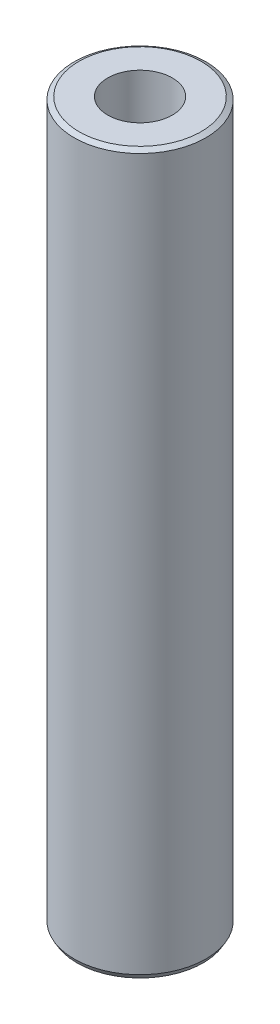
ISO-10303-21;
HEADER;
FILE_DESCRIPTION(('STEP AP214'),'2;1');
FILE_NAME('part.step','',(''),(''),'','','');
FILE_SCHEMA(('AUTOMOTIVE_DESIGN { 1 0 10303 214 1 1 1 1 }'));
ENDSEC;
DATA;
#1=APPLICATION_CONTEXT('core data for automotive mechanical design processes');
#2=APPLICATION_PROTOCOL_DEFINITION('international standard','automotive_design',2000,#1);
#3=PRODUCT_CONTEXT('',#1,'mechanical');
#4=PRODUCT('Part','Part','',(#3));
#5=PRODUCT_RELATED_PRODUCT_CATEGORY('part','',(#4));
#6=PRODUCT_DEFINITION_FORMATION('','',#4);
#7=PRODUCT_DEFINITION_CONTEXT('part definition',#1,'design');
#8=PRODUCT_DEFINITION('design','',#6,#7);
#9=PRODUCT_DEFINITION_SHAPE('','',#8);
#10=(LENGTH_UNIT() NAMED_UNIT(*) SI_UNIT(.MILLI.,.METRE.));
#11=(NAMED_UNIT(*) PLANE_ANGLE_UNIT() SI_UNIT($,.RADIAN.));
#12=(NAMED_UNIT(*) SI_UNIT($,.STERADIAN.) SOLID_ANGLE_UNIT());
#13=UNCERTAINTY_MEASURE_WITH_UNIT(LENGTH_MEASURE(1.E-05),#10,'distance_accuracy_value','');
#14=(GEOMETRIC_REPRESENTATION_CONTEXT(3) GLOBAL_UNCERTAINTY_ASSIGNED_CONTEXT((#13)) GLOBAL_UNIT_ASSIGNED_CONTEXT((#10,
#11,#12)) REPRESENTATION_CONTEXT('',''));
#15=CARTESIAN_POINT('',(0.,0.,0.));
#16=DIRECTION('',(0.,0.,1.));
#17=DIRECTION('',(1.,0.,0.));
#18=AXIS2_PLACEMENT_3D('',#15,#16,#17);
#19=CARTESIAN_POINT('',(0.,600.,0.));
#20=DIRECTION('',(0.,-1.,0.));
#21=DIRECTION('',(0.,0.,-1.));
#22=AXIS2_PLACEMENT_3D('',#19,#20,#21);
#23=CYLINDRICAL_SURFACE('',#22,55.);
#24=CARTESIAN_POINT('',(0.,597.659161060434,0.));
#25=DIRECTION('',(0.,1.,0.));
#26=DIRECTION('',(0.,0.,1.));
#27=AXIS2_PLACEMENT_3D('',#24,#25,#26);
#28=CIRCLE('',#27,55.);
#29=CARTESIAN_POINT('',(0.,597.659161060434,-55.0000000000001));
#30=VERTEX_POINT('',#29);
#31=EDGE_CURVE('E50',#30,#30,#28,.F.);
#32=ORIENTED_EDGE('',*,*,#31,.T.);
#33=EDGE_LOOP('',(#32));
#34=FACE_BOUND('',#33,.T.);
#35=CARTESIAN_POINT('',(0.,4.05445197566379,0.));
#36=DIRECTION('',(0.,1.,0.));
#37=DIRECTION('',(0.,0.,1.));
#38=AXIS2_PLACEMENT_3D('',#35,#36,#37);
#39=CIRCLE('',#38,55.);
#40=CARTESIAN_POINT('',(0.,4.05445197566379,55.));
#41=VERTEX_POINT('',#40);
#42=EDGE_CURVE('E51',#41,#41,#39,.T.);
#43=ORIENTED_EDGE('',*,*,#42,.T.);
#44=EDGE_LOOP('',(#43));
#45=FACE_BOUND('',#44,.T.);
#46=ADVANCED_FACE('F39',(#34,#45),#23,.T.);
#47=CARTESIAN_POINT('',(0.,600.,0.));
#48=DIRECTION('',(0.,1.,0.));
#49=DIRECTION('',(0.,0.,1.));
#50=AXIS2_PLACEMENT_3D('',#47,#48,#49);
#51=PLANE('',#50);
#52=CARTESIAN_POINT('',(0.,600.,0.));
#53=DIRECTION('',(0.,1.,0.));
#54=DIRECTION('',(0.,0.,1.));
#55=AXIS2_PLACEMENT_3D('',#52,#53,#54);
#56=CIRCLE('',#55,50.9455480243363);
#57=CARTESIAN_POINT('',(0.,600.,-50.9455480243364));
#58=VERTEX_POINT('',#57);
#59=EDGE_CURVE('E54',#58,#58,#56,.T.);
#60=ORIENTED_EDGE('',*,*,#59,.T.);
#61=EDGE_LOOP('',(#60));
#62=FACE_BOUND('',#61,.T.);
#63=CARTESIAN_POINT('',(0.,600.,0.));
#64=DIRECTION('',(0.,1.,0.));
#65=DIRECTION('',(0.,0.,1.));
#66=AXIS2_PLACEMENT_3D('',#63,#64,#65);
#67=CIRCLE('',#66,26.9492883840152);
#68=CARTESIAN_POINT('',(0.,600.,26.9492883840152));
#69=VERTEX_POINT('',#68);
#70=EDGE_CURVE('E58',#69,#69,#67,.T.);
#71=ORIENTED_EDGE('',*,*,#70,.F.);
#72=EDGE_LOOP('',(#71));
#73=FACE_BOUND('',#72,.T.);
#74=ADVANCED_FACE('F69',(#62,#73),#51,.T.);
#75=CARTESIAN_POINT('',(0.,0.,0.));
#76=DIRECTION('',(0.,1.,0.));
#77=DIRECTION('',(0.,0.,1.));
#78=AXIS2_PLACEMENT_3D('',#75,#76,#77);
#79=PLANE('',#78);
#80=CARTESIAN_POINT('',(0.,0.,0.));
#81=DIRECTION('',(0.,1.,0.));
#82=DIRECTION('',(0.,0.,1.));
#83=AXIS2_PLACEMENT_3D('',#80,#81,#82);
#84=CIRCLE('',#83,52.6591610604341);
#85=CARTESIAN_POINT('',(0.,0.,52.6591610604341));
#86=VERTEX_POINT('',#85);
#87=EDGE_CURVE('E10',#86,#86,#84,.F.);
#88=ORIENTED_EDGE('',*,*,#87,.T.);
#89=EDGE_LOOP('',(#88));
#90=FACE_BOUND('',#89,.T.);
#91=CARTESIAN_POINT('',(0.,0.,0.));
#92=DIRECTION('',(0.,1.,0.));
#93=DIRECTION('',(0.,0.,1.));
#94=AXIS2_PLACEMENT_3D('',#91,#92,#93);
#95=CIRCLE('',#94,26.9492883840152);
#96=CARTESIAN_POINT('',(0.,0.,26.9492883840152));
#97=VERTEX_POINT('',#96);
#98=EDGE_CURVE('E63',#97,#97,#95,.T.);
#99=ORIENTED_EDGE('',*,*,#98,.T.);
#100=EDGE_LOOP('',(#99));
#101=FACE_BOUND('',#100,.T.);
#102=ADVANCED_FACE('F75',(#90,#101),#79,.F.);
#103=CARTESIAN_POINT('',(0.,600.,0.));
#104=DIRECTION('',(0.,-1.,0.));
#105=DIRECTION('',(0.,0.,-1.));
#106=AXIS2_PLACEMENT_3D('',#103,#104,#105);
#107=CYLINDRICAL_SURFACE('',#106,26.9492883840152);
#108=ORIENTED_EDGE('',*,*,#70,.T.);
#109=EDGE_LOOP('',(#108));
#110=FACE_BOUND('',#109,.T.);
#111=ORIENTED_EDGE('',*,*,#98,.F.);
#112=EDGE_LOOP('',(#111));
#113=FACE_BOUND('',#112,.T.);
#114=ADVANCED_FACE('F70',(#110,#113),#107,.F.);
#115=CARTESIAN_POINT('',(0.,600.,0.));
#116=DIRECTION('',(0.,-1.,0.));
#117=DIRECTION('',(0.,0.,-1.));
#118=AXIS2_PLACEMENT_3D('',#115,#116,#117);
#119=CONICAL_SURFACE('',#118,50.9455480243363,1.04719755119659);
#120=CARTESIAN_POINT('',(0.,597.659161060434,-55.0000000000001));
#121=CARTESIAN_POINT('',(0.,597.683544799388,-54.9577661252536));
#122=CARTESIAN_POINT('',(0.,597.707928538342,-54.9155322505071));
#123=CARTESIAN_POINT('',(0.,597.756696016249,-54.8310645010141));
#124=CARTESIAN_POINT('',(0.,597.781079755203,-54.7888306262676));
#125=CARTESIAN_POINT('',(0.,597.829847233111,-54.7043628767746));
#126=CARTESIAN_POINT('',(0.,597.854230972064,-54.6621290020281));
#127=CARTESIAN_POINT('',(0.,597.902998449972,-54.5776612525351));
#128=CARTESIAN_POINT('',(0.,597.927382188926,-54.5354273777886));
#129=CARTESIAN_POINT('',(0.,597.976149666834,-54.4509596282956));
#130=CARTESIAN_POINT('',(0.,598.000533405787,-54.4087257535491));
#131=CARTESIAN_POINT('',(0.,598.049300883695,-54.3242580040561));
#132=CARTESIAN_POINT('',(0.,598.073684622649,-54.2820241293096));
#133=CARTESIAN_POINT('',(0.,598.122452100557,-54.1975563798167));
#134=CARTESIAN_POINT('',(0.,598.14683583951,-54.1553225050702));
#135=CARTESIAN_POINT('',(0.,598.195603317418,-54.0708547555772));
#136=CARTESIAN_POINT('',(0.,598.219987056372,-54.0286208808307));
#137=CARTESIAN_POINT('',(0.,598.268754534279,-53.9441531313377));
#138=CARTESIAN_POINT('',(0.,598.293138273233,-53.9019192565912));
#139=CARTESIAN_POINT('',(0.,598.341905751141,-53.8174515070982));
#140=CARTESIAN_POINT('',(0.,598.366289490095,-53.7752176323517));
#141=CARTESIAN_POINT('',(0.,598.415056968002,-53.6907498828587));
#142=CARTESIAN_POINT('',(0.,598.439440706956,-53.6485160081122));
#143=CARTESIAN_POINT('',(0.,598.488208184864,-53.5640482586192));
#144=CARTESIAN_POINT('',(0.,598.512591923817,-53.5218143838727));
#145=CARTESIAN_POINT('',(0.,598.561359401725,-53.4373466343797));
#146=CARTESIAN_POINT('',(0.,598.585743140679,-53.3951127596332));
#147=CARTESIAN_POINT('',(0.,598.634510618587,-53.3106450101402));
#148=CARTESIAN_POINT('',(0.,598.65889435754,-53.2684111353937));
#149=CARTESIAN_POINT('',(0.,598.707661835448,-53.1839433859007));
#150=CARTESIAN_POINT('',(0.,598.732045574402,-53.1417095111542));
#151=CARTESIAN_POINT('',(0.,598.780813052309,-53.0572417616612));
#152=CARTESIAN_POINT('',(0.,598.805196791263,-53.0150078869147));
#153=CARTESIAN_POINT('',(0.,598.853964269171,-52.9305401374217));
#154=CARTESIAN_POINT('',(0.,598.878348008125,-52.8883062626752));
#155=CARTESIAN_POINT('',(0.,598.927115486032,-52.8038385131822));
#156=CARTESIAN_POINT('',(0.,598.951499224986,-52.7616046384357));
#157=CARTESIAN_POINT('',(0.,599.000266702894,-52.6771368889427));
#158=CARTESIAN_POINT('',(0.,599.024650441847,-52.6349030141962));
#159=CARTESIAN_POINT('',(0.,599.073417919755,-52.5504352647033));
#160=CARTESIAN_POINT('',(0.,599.097801658709,-52.5082013899568));
#161=CARTESIAN_POINT('',(0.,599.146569136617,-52.4237336404638));
#162=CARTESIAN_POINT('',(0.,599.17095287557,-52.3814997657173));
#163=CARTESIAN_POINT('',(0.,599.219720353478,-52.2970320162243));
#164=CARTESIAN_POINT('',(0.,599.244104092432,-52.2547981414778));
#165=CARTESIAN_POINT('',(0.,599.292871570339,-52.1703303919848));
#166=CARTESIAN_POINT('',(0.,599.317255309293,-52.1280965172383));
#167=CARTESIAN_POINT('',(0.,599.366022787201,-52.0436287677453));
#168=CARTESIAN_POINT('',(0.,599.390406526155,-52.0013948929988));
#169=CARTESIAN_POINT('',(0.,599.439174004062,-51.9169271435058));
#170=CARTESIAN_POINT('',(0.,599.463557743016,-51.8746932687593));
#171=CARTESIAN_POINT('',(0.,599.512325220924,-51.7902255192663));
#172=CARTESIAN_POINT('',(0.,599.536708959877,-51.7479916445198));
#173=CARTESIAN_POINT('',(0.,599.585476437785,-51.6635238950268));
#174=CARTESIAN_POINT('',(0.,599.609860176739,-51.6212900202803));
#175=CARTESIAN_POINT('',(0.,599.658627654647,-51.5368222707873));
#176=CARTESIAN_POINT('',(0.,599.6830113936,-51.4945883960408));
#177=CARTESIAN_POINT('',(0.,599.731778871508,-51.4101206465478));
#178=CARTESIAN_POINT('',(0.,599.756162610462,-51.3678867718013));
#179=CARTESIAN_POINT('',(0.,599.804930088369,-51.2834190223083));
#180=CARTESIAN_POINT('',(0.,599.829313827323,-51.2411851475618));
#181=CARTESIAN_POINT('',(0.,599.878081305231,-51.1567173980688));
#182=CARTESIAN_POINT('',(0.,599.902465044185,-51.1144835233224));
#183=CARTESIAN_POINT('',(0.,599.951232522092,-51.0300157738294));
#184=CARTESIAN_POINT('',(0.,599.975616261046,-50.9877818990829));
#185=CARTESIAN_POINT('',(0.,600.,-50.9455480243364));
#186=B_SPLINE_CURVE_WITH_KNOTS('',3,(#120,#121,#122,#123,#124,#125,#126,#127,#128,#129,#130,
#131,#132,#133,#134,#135,#136,#137,#138,#139,#140,#141,#142,#143,#144,#145,#146,#147,#148,#149,
#150,#151,#152,#153,#154,#155,#156,#157,#158,#159,#160,#161,#162,#163,#164,#165,#166,#167,#168,
#169,#170,#171,#172,#173,#174,#175,#176,#177,#178,#179,#180,#181,#182,#183,#184,#185),
.UNSPECIFIED.,.F.,.F.,(4,2,2,2,2,2,2,2,2,2,2,2,2,2,2,2,2,2,2,2,2,2,2,2,2,2,2,2,2,2,2,2,4),(0.,
0.146302433722885,0.29260486744577,0.438907301168648,0.585209734891478,0.731512168614363,
0.877814602337247,1.02411703606013,1.17041946978296,1.31672190350584,1.46302433722872,
1.60932677095155,1.75562920467443,1.90193163839732,2.0482340721202,2.19453650584303,
2.34083893956592,2.4871413732888,2.63344380701163,2.77974624073451,2.9260486744574,
3.07235110818028,3.2186535419031,3.36495597562599,3.51125840934887,3.6575608430717,
3.80386327679458,3.95016571051747,4.09646814424035,4.24277057796318,4.38907301168607,
4.53537544540894,4.68167787913183),.UNSPECIFIED.);
#187=EDGE_CURVE('BSEAM81',#30,#58,#186,.T.);
#188=ORIENTED_EDGE('',*,*,#31,.F.);
#189=ORIENTED_EDGE('',*,*,#59,.F.);
#190=ORIENTED_EDGE('',*,*,#187,.T.);
#191=ORIENTED_EDGE('',*,*,#187,.F.);
#192=EDGE_LOOP('',(#188,#190,#189,#191));
#193=FACE_BOUND('',#192,.T.);
#194=ADVANCED_FACE('F81',(#193),#119,.T.);
#195=CARTESIAN_POINT('',(0.,4.05445197566379,0.));
#196=DIRECTION('',(0.,1.,0.));
#197=DIRECTION('',(0.,0.,1.));
#198=AXIS2_PLACEMENT_3D('',#195,#196,#197);
#199=CONICAL_SURFACE('',#198,55.,0.523598775598308);
#200=ORIENTED_EDGE('',*,*,#87,.F.);
#201=EDGE_LOOP('',(#200));
#202=FACE_BOUND('',#201,.T.);
#203=ORIENTED_EDGE('',*,*,#42,.F.);
#204=EDGE_LOOP('',(#203));
#205=FACE_BOUND('',#204,.T.);
#206=ADVANCED_FACE('F45',(#202,#205),#199,.T.);
#207=CLOSED_SHELL('',(#46,#74,#102,#114,#194,#206));
#208=MANIFOLD_SOLID_BREP('B2',#207);
#209=ADVANCED_BREP_SHAPE_REPRESENTATION('',(#18,#208),#14);
#210=SHAPE_DEFINITION_REPRESENTATION(#9,#209);
ENDSEC;
END-ISO-10303-21;
